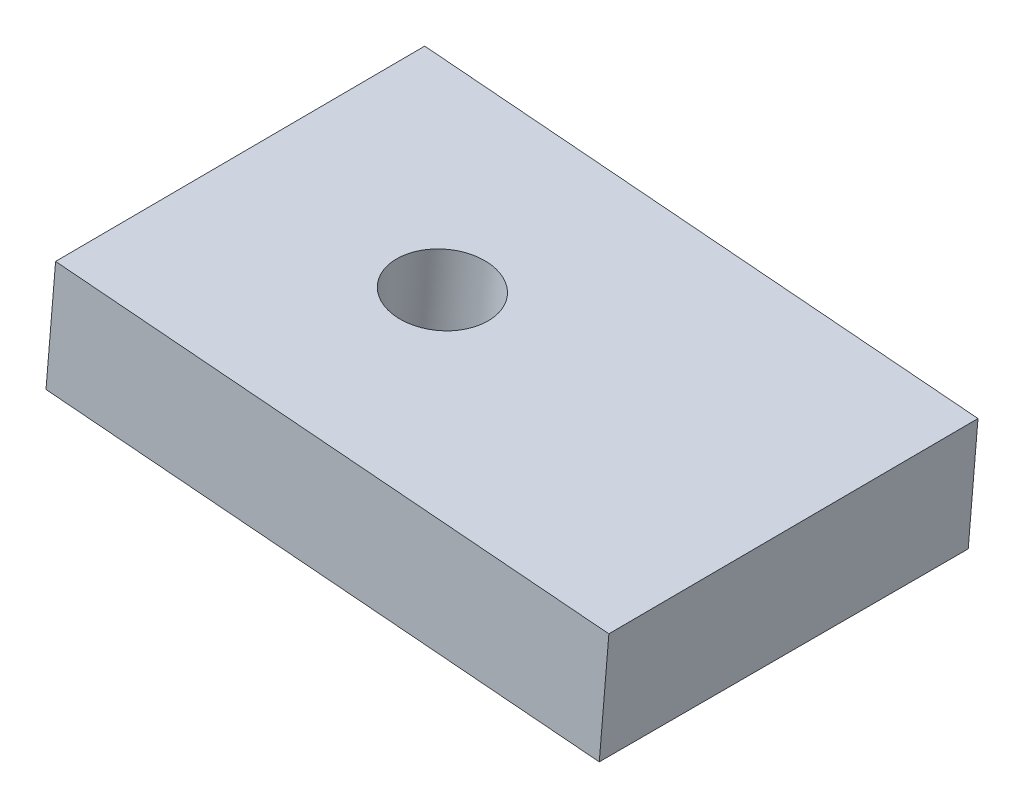
ISO-10303-21;
HEADER;
FILE_DESCRIPTION(('STEP AP214'),'2;1');
FILE_NAME('part.step','',(''),(''),'','','');
FILE_SCHEMA(('AUTOMOTIVE_DESIGN { 1 0 10303 214 1 1 1 1 }'));
ENDSEC;
DATA;
#1=APPLICATION_CONTEXT('core data for automotive mechanical design processes');
#2=APPLICATION_PROTOCOL_DEFINITION('international standard','automotive_design',2000,#1);
#3=PRODUCT_CONTEXT('',#1,'mechanical');
#4=PRODUCT('Part','Part','',(#3));
#5=PRODUCT_RELATED_PRODUCT_CATEGORY('part','',(#4));
#6=PRODUCT_DEFINITION_FORMATION('','',#4);
#7=PRODUCT_DEFINITION_CONTEXT('part definition',#1,'design');
#8=PRODUCT_DEFINITION('design','',#6,#7);
#9=PRODUCT_DEFINITION_SHAPE('','',#8);
#10=(LENGTH_UNIT() NAMED_UNIT(*) SI_UNIT(.MILLI.,.METRE.));
#11=(NAMED_UNIT(*) PLANE_ANGLE_UNIT() SI_UNIT($,.RADIAN.));
#12=(NAMED_UNIT(*) SI_UNIT($,.STERADIAN.) SOLID_ANGLE_UNIT());
#13=UNCERTAINTY_MEASURE_WITH_UNIT(LENGTH_MEASURE(1.E-05),#10,'distance_accuracy_value','');
#14=(GEOMETRIC_REPRESENTATION_CONTEXT(3) GLOBAL_UNCERTAINTY_ASSIGNED_CONTEXT((#13)) GLOBAL_UNIT_ASSIGNED_CONTEXT((#10,
#11,#12)) REPRESENTATION_CONTEXT('',''));
#15=CARTESIAN_POINT('',(0.,0.,0.));
#16=DIRECTION('',(0.,0.,1.));
#17=DIRECTION('',(1.,0.,0.));
#18=AXIS2_PLACEMENT_3D('',#15,#16,#17);
#19=CARTESIAN_POINT('',(-25.1929971261734,-10.6671746696272,0.));
#20=DIRECTION('',(0.,0.,-1.));
#21=DIRECTION('',(-1.,0.,0.));
#22=AXIS2_PLACEMENT_3D('',#19,#20,#21);
#23=PLANE('',#22);
#24=DIRECTION('',(0.996579319521684,-0.0826417564049658,0.));
#25=VECTOR('',#24,1.);
#26=CARTESIAN_POINT('',(-25.4577662493894,-13.8600331484804,0.));
#27=LINE('',#26,#25);
#28=CARTESIAN_POINT('',(-25.4577662493894,-13.8600331484804,0.));
#29=VERTEX_POINT('',#28);
#30=CARTESIAN_POINT('',(-10.4616682072446,-15.1035908434351,0.));
#31=VERTEX_POINT('',#30);
#32=EDGE_CURVE('E101',#29,#31,#27,.T.);
#33=ORIENTED_EDGE('',*,*,#32,.F.);
#34=DIRECTION('',(-0.0826417564049658,-0.996579319521684,0.));
#35=VECTOR('',#34,1.);
#36=CARTESIAN_POINT('',(-25.1929971261734,-10.6671746696272,0.));
#37=LINE('',#36,#35);
#38=CARTESIAN_POINT('',(-25.1929971261734,-10.6671746696272,0.));
#39=VERTEX_POINT('',#38);
#40=EDGE_CURVE('E11',#39,#29,#37,.T.);
#41=ORIENTED_EDGE('',*,*,#40,.F.);
#42=DIRECTION('',(0.996579319521684,-0.0826417564049658,0.));
#43=VECTOR('',#42,1.);
#44=CARTESIAN_POINT('',(-25.1929971261734,-10.6671746696272,0.));
#45=LINE('',#44,#43);
#46=CARTESIAN_POINT('',(-10.1968990840286,-11.9107323645819,0.));
#47=VERTEX_POINT('',#46);
#48=EDGE_CURVE('E89',#39,#47,#45,.T.);
#49=ORIENTED_EDGE('',*,*,#48,.T.);
#50=DIRECTION('',(-0.0826417564049658,-0.996579319521684,0.));
#51=VECTOR('',#50,1.);
#52=CARTESIAN_POINT('',(-10.1968990840286,-11.9107323645819,0.));
#53=LINE('',#52,#51);
#54=EDGE_CURVE('E78',#47,#31,#53,.T.);
#55=ORIENTED_EDGE('',*,*,#54,.T.);
#56=EDGE_LOOP('',(#33,#41,#49,#55));
#57=FACE_BOUND('',#56,.T.);
#58=ADVANCED_FACE('F35',(#57),#23,.T.);
#59=CARTESIAN_POINT('',(-25.1929971261734,-10.6671746696272,9.99999999999999));
#60=DIRECTION('',(-0.996579319521684,0.0826417564049658,0.));
#61=DIRECTION('',(-0.0826417564049658,-0.996579319521684,0.));
#62=AXIS2_PLACEMENT_3D('',#59,#60,#61);
#63=PLANE('',#62);
#64=DIRECTION('',(0.,0.,-1.));
#65=VECTOR('',#64,1.);
#66=CARTESIAN_POINT('',(-25.4577662493894,-13.8600331484804,9.99999999999999));
#67=LINE('',#66,#65);
#68=CARTESIAN_POINT('',(-25.4577662493894,-13.8600331484804,9.99999999999999));
#69=VERTEX_POINT('',#68);
#70=EDGE_CURVE('E93',#69,#29,#67,.T.);
#71=ORIENTED_EDGE('',*,*,#70,.F.);
#72=DIRECTION('',(-0.0826417564049658,-0.996579319521684,0.));
#73=VECTOR('',#72,1.);
#74=CARTESIAN_POINT('',(-25.1929971261734,-10.6671746696272,9.99999999999999));
#75=LINE('',#74,#73);
#76=CARTESIAN_POINT('',(-25.1976958972966,-10.7238372858667,9.99999999999999));
#77=VERTEX_POINT('',#76);
#78=EDGE_CURVE('E45',#77,#69,#75,.T.);
#79=ORIENTED_EDGE('',*,*,#78,.F.);
#80=DIRECTION('',(-0.000469869517572879,-0.00566617003869275,0.999983836739239));
#81=VECTOR('',#80,1.);
#82=CARTESIAN_POINT('',(-25.1929971261734,-10.6671746696272,0.));
#83=LINE('',#82,#81);
#84=EDGE_CURVE('E85',#77,#39,#83,.F.);
#85=ORIENTED_EDGE('',*,*,#84,.T.);
#86=ORIENTED_EDGE('',*,*,#40,.T.);
#87=EDGE_LOOP('',(#71,#79,#85,#86));
#88=FACE_BOUND('',#87,.T.);
#89=ADVANCED_FACE('F110',(#88),#63,.T.);
#90=CARTESIAN_POINT('',(-10.1968990840286,-11.9107323645819,10.));
#91=DIRECTION('',(0.,0.,1.));
#92=DIRECTION('',(1.,0.,0.));
#93=AXIS2_PLACEMENT_3D('',#90,#91,#92);
#94=PLANE('',#93);
#95=DIRECTION('',(-0.996579319521684,0.0826417564049658,0.));
#96=VECTOR('',#95,1.);
#97=CARTESIAN_POINT('',(-10.4616682072446,-15.1035908434351,10.));
#98=LINE('',#97,#96);
#99=CARTESIAN_POINT('',(-10.4616682072446,-15.1035908434351,10.));
#100=VERTEX_POINT('',#99);
#101=EDGE_CURVE('E96',#100,#69,#98,.T.);
#102=ORIENTED_EDGE('',*,*,#101,.F.);
#103=DIRECTION('',(-0.0826417564049658,-0.996579319521684,0.));
#104=VECTOR('',#103,1.);
#105=CARTESIAN_POINT('',(-10.1968990840286,-11.9107323645819,10.));
#106=LINE('',#105,#104);
#107=CARTESIAN_POINT('',(-10.2015978551518,-11.9673949808214,10.));
#108=VERTEX_POINT('',#107);
#109=EDGE_CURVE('E72',#108,#100,#106,.T.);
#110=ORIENTED_EDGE('',*,*,#109,.F.);
#111=DIRECTION('',(0.996579319521684,-0.0826417564049657,0.));
#112=VECTOR('',#111,1.);
#113=CARTESIAN_POINT('',(-25.1976958972966,-10.7238372858667,9.99999999999999));
#114=LINE('',#113,#112);
#115=EDGE_CURVE('E91',#108,#77,#114,.F.);
#116=ORIENTED_EDGE('',*,*,#115,.T.);
#117=ORIENTED_EDGE('',*,*,#78,.T.);
#118=EDGE_LOOP('',(#102,#110,#116,#117));
#119=FACE_BOUND('',#118,.T.);
#120=ADVANCED_FACE('F111',(#119),#94,.T.);
#121=CARTESIAN_POINT('',(-10.1968990840286,-11.9107323645819,0.));
#122=DIRECTION('',(0.996579319521684,-0.0826417564049658,0.));
#123=DIRECTION('',(0.0826417564049658,0.996579319521684,0.));
#124=AXIS2_PLACEMENT_3D('',#121,#122,#123);
#125=PLANE('',#124);
#126=DIRECTION('',(0.,0.,1.));
#127=VECTOR('',#126,1.);
#128=CARTESIAN_POINT('',(-10.4616682072446,-15.1035908434351,0.));
#129=LINE('',#128,#127);
#130=EDGE_CURVE('E83',#31,#100,#129,.T.);
#131=ORIENTED_EDGE('',*,*,#130,.F.);
#132=ORIENTED_EDGE('',*,*,#54,.F.);
#133=DIRECTION('',(0.000469869517573568,0.00566617003869269,-0.999983836739239));
#134=VECTOR('',#133,1.);
#135=CARTESIAN_POINT('',(-10.1968990840286,-11.9107323645819,0.));
#136=LINE('',#135,#134);
#137=EDGE_CURVE('E81',#47,#108,#136,.F.);
#138=ORIENTED_EDGE('',*,*,#137,.T.);
#139=ORIENTED_EDGE('',*,*,#109,.T.);
#140=EDGE_LOOP('',(#131,#132,#138,#139));
#141=FACE_BOUND('',#140,.T.);
#142=ADVANCED_FACE('F80',(#141),#125,.T.);
#143=CARTESIAN_POINT('',(-25.1929971261734,-10.6671746696272,0.));
#144=DIRECTION('',(0.0826404206447072,0.996563211550273,0.00568561872366795));
#145=DIRECTION('',(-0.996579319521684,0.0826417564049657,0.));
#146=AXIS2_PLACEMENT_3D('',#143,#144,#145);
#147=PLANE('',#146);
#148=CARTESIAN_POINT('',(-19.7141602543657,-11.1500356379743,5.));
#149=DIRECTION('',(0.0826404206447072,0.996563211550273,0.00568561872366795));
#150=DIRECTION('',(0.000469869517570446,0.00566617003869295,-0.999983836739239));
#151=AXIS2_PLACEMENT_3D('',#148,#149,#150);
#152=ELLIPSE('',#151,1.25002020440251,1.24999999999999);
#153=CARTESIAN_POINT('',(-19.7135729079753,-11.1429528109443,3.75000000000001));
#154=VERTEX_POINT('',#153);
#155=EDGE_CURVE('E100',#154,#154,#152,.F.);
#156=ORIENTED_EDGE('',*,*,#155,.T.);
#157=EDGE_LOOP('',(#156));
#158=FACE_BOUND('',#157,.T.);
#159=ORIENTED_EDGE('',*,*,#48,.F.);
#160=ORIENTED_EDGE('',*,*,#84,.F.);
#161=ORIENTED_EDGE('',*,*,#115,.F.);
#162=ORIENTED_EDGE('',*,*,#137,.F.);
#163=EDGE_LOOP('',(#159,#160,#161,#162));
#164=FACE_BOUND('',#163,.T.);
#165=ADVANCED_FACE('F37',(#158,#164),#147,.T.);
#166=CARTESIAN_POINT('',(-1.31536726133734,-15.8620516703576,0.));
#167=DIRECTION('',(-0.0826417564049658,-0.996579319521684,0.));
#168=DIRECTION('',(0.996579319521684,-0.0826417564049658,0.));
#169=AXIS2_PLACEMENT_3D('',#166,#167,#168);
#170=PLANE('',#169);
#171=CARTESIAN_POINT('',(-19.9765799920201,-14.3145628087078,5.));
#172=DIRECTION('',(-0.0826417564049658,-0.996579319521684,0.));
#173=DIRECTION('',(0.996579319521684,-0.0826417564049658,0.));
#174=AXIS2_PLACEMENT_3D('',#171,#172,#173);
#175=CIRCLE('',#174,1.24999999999999);
#176=CARTESIAN_POINT('',(-18.730855842618,-14.417865004214,5.));
#177=VERTEX_POINT('',#176);
#178=EDGE_CURVE('E39',#177,#177,#175,.T.);
#179=ORIENTED_EDGE('',*,*,#178,.F.);
#180=EDGE_LOOP('',(#179));
#181=FACE_BOUND('',#180,.T.);
#182=ORIENTED_EDGE('',*,*,#32,.T.);
#183=ORIENTED_EDGE('',*,*,#130,.T.);
#184=ORIENTED_EDGE('',*,*,#101,.T.);
#185=ORIENTED_EDGE('',*,*,#70,.T.);
#186=EDGE_LOOP('',(#182,#183,#184,#185));
#187=FACE_BOUND('',#186,.T.);
#188=ADVANCED_FACE('F146',(#181,#187),#170,.T.);
#189=CARTESIAN_POINT('',(-19.7135729079753,-11.1429528109442,5.));
#190=DIRECTION('',(0.0826417564049658,0.996579319521684,0.));
#191=DIRECTION('',(-0.996579319521684,0.0826417564049658,0.));
#192=AXIS2_PLACEMENT_3D('',#189,#190,#191);
#193=CYLINDRICAL_SURFACE('',#192,1.24999999999999);
#194=ORIENTED_EDGE('',*,*,#178,.T.);
#195=EDGE_LOOP('',(#194));
#196=FACE_BOUND('',#195,.T.);
#197=ORIENTED_EDGE('',*,*,#155,.F.);
#198=EDGE_LOOP('',(#197));
#199=FACE_BOUND('',#198,.T.);
#200=ADVANCED_FACE('F155',(#196,#199),#193,.F.);
#201=CLOSED_SHELL('',(#58,#89,#120,#142,#165,#188,#200));
#202=MANIFOLD_SOLID_BREP('B2',#201);
#203=ADVANCED_BREP_SHAPE_REPRESENTATION('',(#18,#202),#14);
#204=SHAPE_DEFINITION_REPRESENTATION(#9,#203);
ENDSEC;
END-ISO-10303-21;
